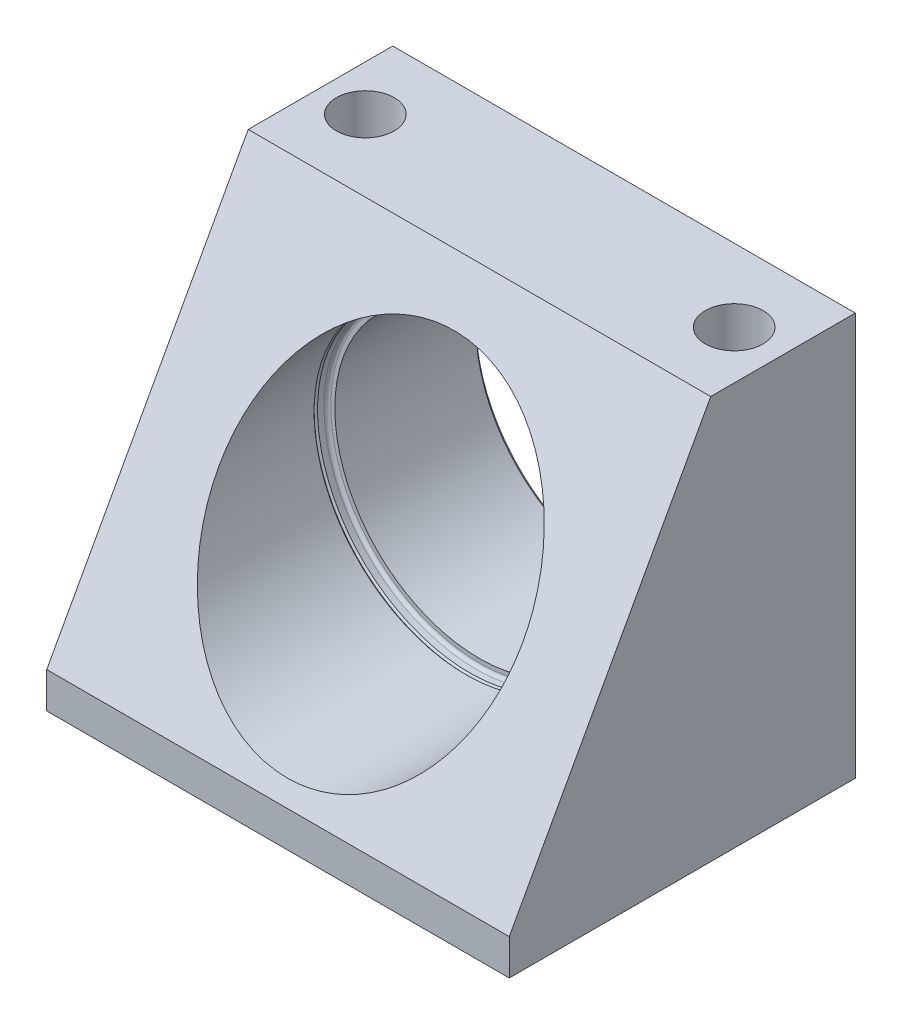
ISO-10303-21;
HEADER;
FILE_DESCRIPTION(('STEP AP214'),'2;1');
FILE_NAME('part.step','',(''),(''),'','','');
FILE_SCHEMA(('AUTOMOTIVE_DESIGN { 1 0 10303 214 1 1 1 1 }'));
ENDSEC;
DATA;
#1=APPLICATION_CONTEXT('core data for automotive mechanical design processes');
#2=APPLICATION_PROTOCOL_DEFINITION('international standard','automotive_design',2000,#1);
#3=PRODUCT_CONTEXT('',#1,'mechanical');
#4=PRODUCT('Part','Part','',(#3));
#5=PRODUCT_RELATED_PRODUCT_CATEGORY('part','',(#4));
#6=PRODUCT_DEFINITION_FORMATION('','',#4);
#7=PRODUCT_DEFINITION_CONTEXT('part definition',#1,'design');
#8=PRODUCT_DEFINITION('design','',#6,#7);
#9=PRODUCT_DEFINITION_SHAPE('','',#8);
#10=(LENGTH_UNIT() NAMED_UNIT(*) SI_UNIT(.MILLI.,.METRE.));
#11=(NAMED_UNIT(*) PLANE_ANGLE_UNIT() SI_UNIT($,.RADIAN.));
#12=(NAMED_UNIT(*) SI_UNIT($,.STERADIAN.) SOLID_ANGLE_UNIT());
#13=UNCERTAINTY_MEASURE_WITH_UNIT(LENGTH_MEASURE(1.E-05),#10,'distance_accuracy_value','');
#14=(GEOMETRIC_REPRESENTATION_CONTEXT(3) GLOBAL_UNCERTAINTY_ASSIGNED_CONTEXT((#13)) GLOBAL_UNIT_ASSIGNED_CONTEXT((#10,
#11,#12)) REPRESENTATION_CONTEXT('',''));
#15=CARTESIAN_POINT('',(0.,0.,0.));
#16=DIRECTION('',(0.,0.,1.));
#17=DIRECTION('',(1.,0.,0.));
#18=AXIS2_PLACEMENT_3D('',#15,#16,#17);
#19=CARTESIAN_POINT('',(50.8,45.0088,-75.9968));
#20=DIRECTION('',(0.,0.,1.));
#21=DIRECTION('',(1.,0.,0.));
#22=AXIS2_PLACEMENT_3D('',#19,#20,#21);
#23=CYLINDRICAL_SURFACE('',#22,31.7627);
#24=CARTESIAN_POINT('',(50.8,45.0088,-44.2468));
#25=DIRECTION('',(0.,0.,1.));
#26=DIRECTION('',(1.,0.,0.));
#27=AXIS2_PLACEMENT_3D('',#24,#25,#26);
#28=CIRCLE('',#27,31.7627);
#29=CARTESIAN_POINT('',(82.5627,45.0088,-44.2468));
#30=VERTEX_POINT('',#29);
#31=EDGE_CURVE('E119',#30,#30,#28,.F.);
#32=ORIENTED_EDGE('',*,*,#31,.F.);
#33=EDGE_LOOP('',(#32));
#34=FACE_BOUND('',#33,.T.);
#35=CARTESIAN_POINT('',(50.8,45.0088,-75.2475));
#36=DIRECTION('',(0.,0.,1.));
#37=DIRECTION('',(1.,0.,0.));
#38=AXIS2_PLACEMENT_3D('',#35,#36,#37);
#39=CIRCLE('',#38,31.7627);
#40=CARTESIAN_POINT('',(82.5627,45.0088,-75.2475));
#41=VERTEX_POINT('',#40);
#42=EDGE_CURVE('E204',#41,#41,#39,.T.);
#43=ORIENTED_EDGE('',*,*,#42,.F.);
#44=EDGE_LOOP('',(#43));
#45=FACE_BOUND('',#44,.T.);
#46=ADVANCED_FACE('F35',(#34,#45),#23,.F.);
#47=CARTESIAN_POINT('',(0.,0.,-75.9968));
#48=DIRECTION('',(0.,0.,1.));
#49=DIRECTION('',(1.,0.,0.));
#50=AXIS2_PLACEMENT_3D('',#47,#48,#49);
#51=PLANE('',#50);
#52=DIRECTION('',(0.,-1.,0.));
#53=VECTOR('',#52,1.);
#54=CARTESIAN_POINT('',(0.,88.4936,-75.9968));
#55=LINE('',#54,#53);
#56=CARTESIAN_POINT('',(0.,88.4936,-75.9968));
#57=VERTEX_POINT('',#56);
#58=CARTESIAN_POINT('',(0.,0.,-75.9968));
#59=VERTEX_POINT('',#58);
#60=EDGE_CURVE('E128',#57,#59,#55,.T.);
#61=ORIENTED_EDGE('',*,*,#60,.F.);
#62=DIRECTION('',(-1.,0.,0.));
#63=VECTOR('',#62,1.);
#64=CARTESIAN_POINT('',(0.,88.4936,-75.9968));
#65=LINE('',#64,#63);
#66=CARTESIAN_POINT('',(101.6,88.4936,-75.9968));
#67=VERTEX_POINT('',#66);
#68=EDGE_CURVE('E105',#67,#57,#65,.T.);
#69=ORIENTED_EDGE('',*,*,#68,.F.);
#70=DIRECTION('',(0.,1.,0.));
#71=VECTOR('',#70,1.);
#72=CARTESIAN_POINT('',(101.6,88.4936,-75.9968));
#73=LINE('',#72,#71);
#74=CARTESIAN_POINT('',(101.6,0.,-75.9968));
#75=VERTEX_POINT('',#74);
#76=EDGE_CURVE('E132',#75,#67,#73,.T.);
#77=ORIENTED_EDGE('',*,*,#76,.F.);
#78=DIRECTION('',(1.,0.,0.));
#79=VECTOR('',#78,1.);
#80=CARTESIAN_POINT('',(0.,0.,-75.9968));
#81=LINE('',#80,#79);
#82=EDGE_CURVE('E130',#59,#75,#81,.T.);
#83=ORIENTED_EDGE('',*,*,#82,.F.);
#84=EDGE_LOOP('',(#61,#69,#77,#83));
#85=FACE_BOUND('',#84,.T.);
#86=CARTESIAN_POINT('',(50.8,45.0088,-75.9968));
#87=DIRECTION('',(0.,0.,1.));
#88=DIRECTION('',(1.,0.,0.));
#89=AXIS2_PLACEMENT_3D('',#86,#87,#88);
#90=CIRCLE('',#89,32.512);
#91=CARTESIAN_POINT('',(83.312,45.0088,-75.9968));
#92=VERTEX_POINT('',#91);
#93=EDGE_CURVE('E201',#92,#92,#90,.T.);
#94=ORIENTED_EDGE('',*,*,#93,.T.);
#95=EDGE_LOOP('',(#94));
#96=FACE_BOUND('',#95,.T.);
#97=ADVANCED_FACE('F145',(#85,#96),#51,.F.);
#98=CARTESIAN_POINT('',(50.8,45.0088,-170.469094393648));
#99=DIRECTION('',(0.,0.,1.));
#100=DIRECTION('',(1.,0.,0.));
#101=AXIS2_PLACEMENT_3D('',#98,#99,#100);
#102=CYLINDRICAL_SURFACE('',#101,33.401);
#103=CARTESIAN_POINT('',(50.8,45.0088,-20.3808511657215));
#104=DIRECTION('',(0.,-0.481133968212926,-0.876647081003344));
#105=DIRECTION('',(0.,-0.876647081003344,0.481133968212926));
#106=AXIS2_PLACEMENT_3D('',#103,#104,#105);
#107=ELLIPSE('',#106,38.1008512134344,33.401);
#108=CARTESIAN_POINT('',(50.8,11.6078,-2.04923742911151));
#109=VERTEX_POINT('',#108);
#110=EDGE_CURVE('E116',#109,#109,#107,.F.);
#111=ORIENTED_EDGE('',*,*,#110,.T.);
#112=EDGE_LOOP('',(#111));
#113=FACE_BOUND('',#112,.T.);
#114=CARTESIAN_POINT('',(50.8,45.0088,-41.3258));
#115=DIRECTION('',(0.,0.,1.));
#116=DIRECTION('',(1.,0.,0.));
#117=AXIS2_PLACEMENT_3D('',#114,#115,#116);
#118=CIRCLE('',#117,33.401);
#119=CARTESIAN_POINT('',(84.201,45.0088,-41.3258));
#120=VERTEX_POINT('',#119);
#121=EDGE_CURVE('E198',#120,#120,#118,.T.);
#122=ORIENTED_EDGE('',*,*,#121,.F.);
#123=EDGE_LOOP('',(#122));
#124=FACE_BOUND('',#123,.T.);
#125=ADVANCED_FACE('F166',(#113,#124),#102,.F.);
#126=CARTESIAN_POINT('',(50.8,45.0088,-43.4848));
#127=DIRECTION('',(0.,0.,1.));
#128=DIRECTION('',(1.,0.,0.));
#129=AXIS2_PLACEMENT_3D('',#126,#127,#128);
#130=CIRCLE('',#129,33.401);
#131=CARTESIAN_POINT('',(84.201,45.0088,-43.4848));
#132=VERTEX_POINT('',#131);
#133=EDGE_CURVE('E12',#132,#132,#130,.F.);
#134=ORIENTED_EDGE('',*,*,#133,.T.);
#135=EDGE_LOOP('',(#134));
#136=FACE_BOUND('',#135,.T.);
#137=CARTESIAN_POINT('',(50.8,45.0088,-42.0878));
#138=DIRECTION('',(0.,0.,1.));
#139=DIRECTION('',(1.,0.,0.));
#140=AXIS2_PLACEMENT_3D('',#137,#138,#139);
#141=CIRCLE('',#140,33.401);
#142=CARTESIAN_POINT('',(84.201,45.0088,-42.0878));
#143=VERTEX_POINT('',#142);
#144=EDGE_CURVE('E195',#143,#143,#141,.T.);
#145=ORIENTED_EDGE('',*,*,#144,.T.);
#146=EDGE_LOOP('',(#145));
#147=FACE_BOUND('',#146,.T.);
#148=ADVANCED_FACE('F234',(#136,#147),#102,.F.);
#149=CARTESIAN_POINT('',(0.,88.4936,-44.2468));
#150=DIRECTION('',(0.,-0.481133968212926,-0.876647081003344));
#151=DIRECTION('',(0.,0.876647081003344,-0.481133968212926));
#152=AXIS2_PLACEMENT_3D('',#149,#150,#151);
#153=PLANE('',#152);
#154=DIRECTION('',(0.,0.876647081003344,-0.481133968212926));
#155=VECTOR('',#154,1.);
#156=CARTESIAN_POINT('',(101.6,88.4936,-44.2468));
#157=LINE('',#156,#155);
#158=CARTESIAN_POINT('',(101.6,7.874,0.));
#159=VERTEX_POINT('',#158);
#160=CARTESIAN_POINT('',(101.6,88.4936,-44.2468));
#161=VERTEX_POINT('',#160);
#162=EDGE_CURVE('E93',#159,#161,#157,.T.);
#163=ORIENTED_EDGE('',*,*,#162,.T.);
#164=DIRECTION('',(1.,0.,0.));
#165=VECTOR('',#164,1.);
#166=CARTESIAN_POINT('',(0.,88.4936,-44.2468));
#167=LINE('',#166,#165);
#168=CARTESIAN_POINT('',(0.,88.4936,-44.2468));
#169=VERTEX_POINT('',#168);
#170=EDGE_CURVE('E89',#169,#161,#167,.T.);
#171=ORIENTED_EDGE('',*,*,#170,.F.);
#172=DIRECTION('',(0.,0.876647081003344,-0.481133968212926));
#173=VECTOR('',#172,1.);
#174=CARTESIAN_POINT('',(0.,88.4936,-44.2468));
#175=LINE('',#174,#173);
#176=CARTESIAN_POINT('',(0.,7.87400000000002,0.));
#177=VERTEX_POINT('',#176);
#178=EDGE_CURVE('E50',#177,#169,#175,.T.);
#179=ORIENTED_EDGE('',*,*,#178,.F.);
#180=DIRECTION('',(1.,0.,0.));
#181=VECTOR('',#180,1.);
#182=CARTESIAN_POINT('',(0.,7.87400000000001,0.));
#183=LINE('',#182,#181);
#184=EDGE_CURVE('E97',#177,#159,#183,.T.);
#185=ORIENTED_EDGE('',*,*,#184,.T.);
#186=EDGE_LOOP('',(#163,#171,#179,#185));
#187=FACE_BOUND('',#186,.T.);
#188=ORIENTED_EDGE('',*,*,#110,.F.);
#189=EDGE_LOOP('',(#188));
#190=FACE_BOUND('',#189,.T.);
#191=ADVANCED_FACE('F90',(#187,#190),#153,.F.);
#192=CARTESIAN_POINT('',(0.,88.4936,-75.9968));
#193=DIRECTION('',(-1.,0.,0.));
#194=DIRECTION('',(0.,0.,1.));
#195=AXIS2_PLACEMENT_3D('',#192,#193,#194);
#196=PLANE('',#195);
#197=ORIENTED_EDGE('',*,*,#178,.T.);
#198=DIRECTION('',(0.,0.,1.));
#199=VECTOR('',#198,1.);
#200=CARTESIAN_POINT('',(0.,88.4936,-75.9968));
#201=LINE('',#200,#199);
#202=EDGE_CURVE('E58',#57,#169,#201,.T.);
#203=ORIENTED_EDGE('',*,*,#202,.F.);
#204=ORIENTED_EDGE('',*,*,#60,.T.);
#205=DIRECTION('',(0.,0.,1.));
#206=VECTOR('',#205,1.);
#207=CARTESIAN_POINT('',(0.,0.,-75.9968));
#208=LINE('',#207,#206);
#209=CARTESIAN_POINT('',(0.,0.,0.));
#210=VERTEX_POINT('',#209);
#211=EDGE_CURVE('E80',#59,#210,#208,.T.);
#212=ORIENTED_EDGE('',*,*,#211,.T.);
#213=DIRECTION('',(0.,-1.,0.));
#214=VECTOR('',#213,1.);
#215=CARTESIAN_POINT('',(0.,88.4936,0.));
#216=LINE('',#215,#214);
#217=EDGE_CURVE('E96',#177,#210,#216,.T.);
#218=ORIENTED_EDGE('',*,*,#217,.F.);
#219=EDGE_LOOP('',(#197,#203,#204,#212,#218));
#220=FACE_BOUND('',#219,.T.);
#221=ADVANCED_FACE('F100',(#220),#196,.T.);
#222=CARTESIAN_POINT('',(0.,88.4936,-75.9968));
#223=DIRECTION('',(0.,1.,0.));
#224=DIRECTION('',(-1.,0.,0.));
#225=AXIS2_PLACEMENT_3D('',#222,#223,#224);
#226=PLANE('',#225);
#227=CARTESIAN_POINT('',(9.98219999999998,88.4936,-59.9948));
#228=DIRECTION('',(0.,1.,0.));
#229=DIRECTION('',(0.,0.,1.));
#230=AXIS2_PLACEMENT_3D('',#227,#228,#229);
#231=CIRCLE('',#230,6.35000000000001);
#232=CARTESIAN_POINT('',(9.98219999999998,88.4936,-53.6448));
#233=VERTEX_POINT('',#232);
#234=EDGE_CURVE('E180',#233,#233,#231,.T.);
#235=ORIENTED_EDGE('',*,*,#234,.F.);
#236=EDGE_LOOP('',(#235));
#237=FACE_BOUND('',#236,.T.);
#238=CARTESIAN_POINT('',(91.0082,88.4936,-59.9948));
#239=DIRECTION('',(0.,1.,0.));
#240=DIRECTION('',(0.,0.,1.));
#241=AXIS2_PLACEMENT_3D('',#238,#239,#240);
#242=CIRCLE('',#241,6.35000000000001);
#243=CARTESIAN_POINT('',(91.0082,88.4936,-53.6448));
#244=VERTEX_POINT('',#243);
#245=EDGE_CURVE('E183',#244,#244,#242,.T.);
#246=ORIENTED_EDGE('',*,*,#245,.F.);
#247=EDGE_LOOP('',(#246));
#248=FACE_BOUND('',#247,.T.);
#249=ORIENTED_EDGE('',*,*,#170,.T.);
#250=DIRECTION('',(0.,0.,1.));
#251=VECTOR('',#250,1.);
#252=CARTESIAN_POINT('',(101.6,88.4936,-75.9968));
#253=LINE('',#252,#251);
#254=EDGE_CURVE('E106',#67,#161,#253,.T.);
#255=ORIENTED_EDGE('',*,*,#254,.F.);
#256=ORIENTED_EDGE('',*,*,#68,.T.);
#257=ORIENTED_EDGE('',*,*,#202,.T.);
#258=EDGE_LOOP('',(#249,#255,#256,#257));
#259=FACE_BOUND('',#258,.T.);
#260=ADVANCED_FACE('F103',(#237,#248,#259),#226,.T.);
#261=CARTESIAN_POINT('',(101.6,88.4936,-75.9968));
#262=DIRECTION('',(1.,0.,0.));
#263=DIRECTION('',(0.,1.,0.));
#264=AXIS2_PLACEMENT_3D('',#261,#262,#263);
#265=PLANE('',#264);
#266=ORIENTED_EDGE('',*,*,#162,.F.);
#267=DIRECTION('',(0.,1.,0.));
#268=VECTOR('',#267,1.);
#269=CARTESIAN_POINT('',(101.6,88.4936,0.));
#270=LINE('',#269,#268);
#271=CARTESIAN_POINT('',(101.6,0.,0.));
#272=VERTEX_POINT('',#271);
#273=EDGE_CURVE('E111',#272,#159,#270,.T.);
#274=ORIENTED_EDGE('',*,*,#273,.F.);
#275=DIRECTION('',(0.,0.,1.));
#276=VECTOR('',#275,1.);
#277=CARTESIAN_POINT('',(101.6,0.,-75.9968));
#278=LINE('',#277,#276);
#279=EDGE_CURVE('E75',#75,#272,#278,.T.);
#280=ORIENTED_EDGE('',*,*,#279,.F.);
#281=ORIENTED_EDGE('',*,*,#76,.T.);
#282=ORIENTED_EDGE('',*,*,#254,.T.);
#283=EDGE_LOOP('',(#266,#274,#280,#281,#282));
#284=FACE_BOUND('',#283,.T.);
#285=ADVANCED_FACE('F142',(#284),#265,.T.);
#286=CARTESIAN_POINT('',(0.,0.,-75.9968));
#287=DIRECTION('',(0.,-1.,0.));
#288=DIRECTION('',(0.,0.,-1.));
#289=AXIS2_PLACEMENT_3D('',#286,#287,#288);
#290=PLANE('',#289);
#291=CARTESIAN_POINT('',(9.98219999999998,0.,-59.9948));
#292=DIRECTION('',(0.,-1.,0.));
#293=DIRECTION('',(0.,0.,-1.));
#294=AXIS2_PLACEMENT_3D('',#291,#292,#293);
#295=CIRCLE('',#294,6.35000000000001);
#296=CARTESIAN_POINT('',(9.98219999999998,0.,-66.3448));
#297=VERTEX_POINT('',#296);
#298=EDGE_CURVE('E185',#297,#297,#295,.T.);
#299=ORIENTED_EDGE('',*,*,#298,.F.);
#300=EDGE_LOOP('',(#299));
#301=FACE_BOUND('',#300,.T.);
#302=CARTESIAN_POINT('',(91.0082,0.,-59.9948));
#303=DIRECTION('',(0.,-1.,0.));
#304=DIRECTION('',(0.,0.,-1.));
#305=AXIS2_PLACEMENT_3D('',#302,#303,#304);
#306=CIRCLE('',#305,6.35000000000001);
#307=CARTESIAN_POINT('',(91.0082,0.,-66.3448));
#308=VERTEX_POINT('',#307);
#309=EDGE_CURVE('E120',#308,#308,#306,.T.);
#310=ORIENTED_EDGE('',*,*,#309,.F.);
#311=EDGE_LOOP('',(#310));
#312=FACE_BOUND('',#311,.T.);
#313=DIRECTION('',(1.,0.,0.));
#314=VECTOR('',#313,1.);
#315=CARTESIAN_POINT('',(0.,0.,0.));
#316=LINE('',#315,#314);
#317=EDGE_CURVE('E136',#210,#272,#316,.T.);
#318=ORIENTED_EDGE('',*,*,#317,.F.);
#319=ORIENTED_EDGE('',*,*,#211,.F.);
#320=ORIENTED_EDGE('',*,*,#82,.T.);
#321=ORIENTED_EDGE('',*,*,#279,.T.);
#322=EDGE_LOOP('',(#318,#319,#320,#321));
#323=FACE_BOUND('',#322,.T.);
#324=ADVANCED_FACE('F147',(#301,#312,#323),#290,.T.);
#325=CARTESIAN_POINT('',(0.,0.,0.));
#326=DIRECTION('',(0.,0.,1.));
#327=DIRECTION('',(1.,0.,0.));
#328=AXIS2_PLACEMENT_3D('',#325,#326,#327);
#329=PLANE('',#328);
#330=ORIENTED_EDGE('',*,*,#184,.F.);
#331=ORIENTED_EDGE('',*,*,#217,.T.);
#332=ORIENTED_EDGE('',*,*,#317,.T.);
#333=ORIENTED_EDGE('',*,*,#273,.T.);
#334=EDGE_LOOP('',(#330,#331,#332,#333));
#335=FACE_BOUND('',#334,.T.);
#336=ADVANCED_FACE('F140',(#335),#329,.T.);
#337=CARTESIAN_POINT('',(0.,0.,-44.2468));
#338=DIRECTION('',(0.,0.,1.));
#339=DIRECTION('',(1.,0.,0.));
#340=AXIS2_PLACEMENT_3D('',#337,#338,#339);
#341=PLANE('',#340);
#342=CARTESIAN_POINT('',(50.8,45.0088,-44.2468));
#343=DIRECTION('',(0.,0.,1.));
#344=DIRECTION('',(1.,0.,0.));
#345=AXIS2_PLACEMENT_3D('',#342,#343,#344);
#346=CIRCLE('',#345,32.639);
#347=CARTESIAN_POINT('',(83.439,45.0088,-44.2468));
#348=VERTEX_POINT('',#347);
#349=EDGE_CURVE('E43',#348,#348,#346,.T.);
#350=ORIENTED_EDGE('',*,*,#349,.T.);
#351=EDGE_LOOP('',(#350));
#352=FACE_BOUND('',#351,.T.);
#353=ORIENTED_EDGE('',*,*,#31,.T.);
#354=EDGE_LOOP('',(#353));
#355=FACE_BOUND('',#354,.T.);
#356=ADVANCED_FACE('F155',(#352,#355),#341,.T.);
#357=CARTESIAN_POINT('',(50.8,45.0088,-43.4848));
#358=DIRECTION('',(0.,0.,1.));
#359=DIRECTION('',(1.,0.,0.));
#360=AXIS2_PLACEMENT_3D('',#357,#358,#359);
#361=TOROIDAL_SURFACE('',#360,32.639,0.762);
#362=ORIENTED_EDGE('',*,*,#133,.F.);
#363=EDGE_LOOP('',(#362));
#364=FACE_BOUND('',#363,.T.);
#365=ORIENTED_EDGE('',*,*,#349,.F.);
#366=EDGE_LOOP('',(#365));
#367=FACE_BOUND('',#366,.T.);
#368=ADVANCED_FACE('F37',(#364,#367),#361,.F.);
#369=CARTESIAN_POINT('',(91.0082,88.4936,-59.9948));
#370=DIRECTION('',(0.,1.,0.));
#371=DIRECTION('',(0.,0.,1.));
#372=AXIS2_PLACEMENT_3D('',#369,#370,#371);
#373=CYLINDRICAL_SURFACE('',#372,6.35000000000001);
#374=ORIENTED_EDGE('',*,*,#245,.T.);
#375=EDGE_LOOP('',(#374));
#376=FACE_BOUND('',#375,.T.);
#377=ORIENTED_EDGE('',*,*,#309,.T.);
#378=EDGE_LOOP('',(#377));
#379=FACE_BOUND('',#378,.T.);
#380=ADVANCED_FACE('F227',(#376,#379),#373,.F.);
#381=CARTESIAN_POINT('',(9.98219999999998,88.4936,-59.9948));
#382=DIRECTION('',(0.,1.,0.));
#383=DIRECTION('',(0.,0.,1.));
#384=AXIS2_PLACEMENT_3D('',#381,#382,#383);
#385=CYLINDRICAL_SURFACE('',#384,6.35000000000001);
#386=ORIENTED_EDGE('',*,*,#234,.T.);
#387=EDGE_LOOP('',(#386));
#388=FACE_BOUND('',#387,.T.);
#389=ORIENTED_EDGE('',*,*,#298,.T.);
#390=EDGE_LOOP('',(#389));
#391=FACE_BOUND('',#390,.T.);
#392=ADVANCED_FACE('F223',(#388,#391),#385,.F.);
#393=CARTESIAN_POINT('',(50.8,45.0088,-41.7068));
#394=DIRECTION('',(0.,0.,-1.));
#395=DIRECTION('',(-1.,0.,0.));
#396=AXIS2_PLACEMENT_3D('',#393,#394,#395);
#397=CONICAL_SURFACE('',#396,33.782,0.785398163397466);
#398=ORIENTED_EDGE('',*,*,#121,.T.);
#399=EDGE_LOOP('',(#398));
#400=FACE_BOUND('',#399,.T.);
#401=CARTESIAN_POINT('',(50.8,45.0088,-41.7068));
#402=DIRECTION('',(0.,0.,1.));
#403=DIRECTION('',(1.,0.,0.));
#404=AXIS2_PLACEMENT_3D('',#401,#402,#403);
#405=CIRCLE('',#404,33.782);
#406=CARTESIAN_POINT('',(84.582,45.0088,-41.7068));
#407=VERTEX_POINT('',#406);
#408=EDGE_CURVE('E192',#407,#407,#405,.T.);
#409=ORIENTED_EDGE('',*,*,#408,.F.);
#410=EDGE_LOOP('',(#409));
#411=FACE_BOUND('',#410,.T.);
#412=ADVANCED_FACE('F217',(#400,#411),#397,.F.);
#413=CARTESIAN_POINT('',(50.8,45.0088,-42.0878));
#414=DIRECTION('',(0.,0.,1.));
#415=DIRECTION('',(1.,0.,0.));
#416=AXIS2_PLACEMENT_3D('',#413,#414,#415);
#417=CONICAL_SURFACE('',#416,33.401,0.785398163397448);
#418=ORIENTED_EDGE('',*,*,#408,.T.);
#419=EDGE_LOOP('',(#418));
#420=FACE_BOUND('',#419,.T.);
#421=ORIENTED_EDGE('',*,*,#144,.F.);
#422=EDGE_LOOP('',(#421));
#423=FACE_BOUND('',#422,.T.);
#424=ADVANCED_FACE('F211',(#420,#423),#417,.F.);
#425=CARTESIAN_POINT('',(50.8,45.0088,-75.9968));
#426=DIRECTION('',(0.,0.,-1.));
#427=DIRECTION('',(-1.,0.,0.));
#428=AXIS2_PLACEMENT_3D('',#425,#426,#427);
#429=CONICAL_SURFACE('',#428,32.512,0.785398163397444);
#430=ORIENTED_EDGE('',*,*,#42,.T.);
#431=EDGE_LOOP('',(#430));
#432=FACE_BOUND('',#431,.T.);
#433=ORIENTED_EDGE('',*,*,#93,.F.);
#434=EDGE_LOOP('',(#433));
#435=FACE_BOUND('',#434,.T.);
#436=ADVANCED_FACE('F208',(#432,#435),#429,.F.);
#437=CLOSED_SHELL('',(#46,#97,#125,#148,#191,#221,#260,#285,#324,#336,#356,#368,#380,#392,#412,
#424,#436));
#438=MANIFOLD_SOLID_BREP('B2',#437);
#439=ADVANCED_BREP_SHAPE_REPRESENTATION('',(#18,#438),#14);
#440=SHAPE_DEFINITION_REPRESENTATION(#9,#439);
ENDSEC;
END-ISO-10303-21;
